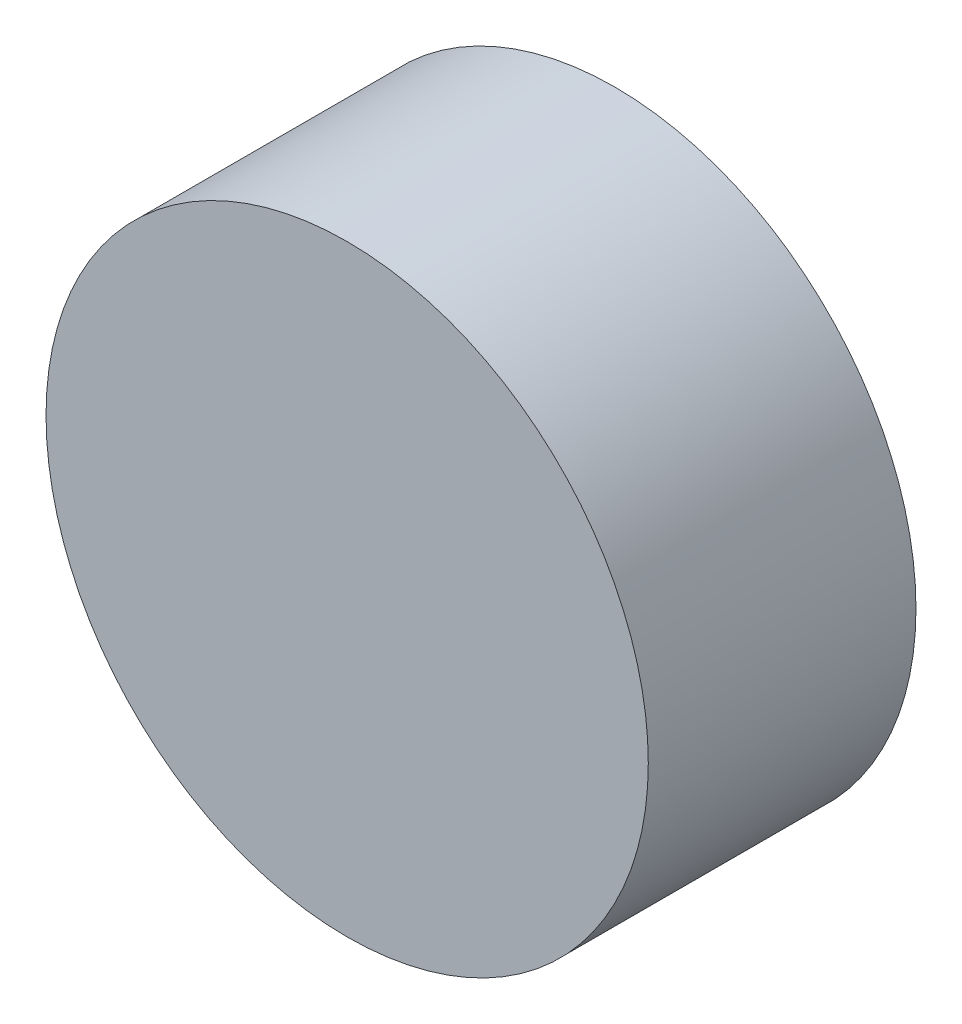
ISO-10303-21;
HEADER;
FILE_DESCRIPTION(('STEP AP214'),'2;1');
FILE_NAME('part.step','',(''),(''),'','','');
FILE_SCHEMA(('AUTOMOTIVE_DESIGN { 1 0 10303 214 1 1 1 1 }'));
ENDSEC;
DATA;
#1=APPLICATION_CONTEXT('core data for automotive mechanical design processes');
#2=APPLICATION_PROTOCOL_DEFINITION('international standard','automotive_design',2000,#1);
#3=PRODUCT_CONTEXT('',#1,'mechanical');
#4=PRODUCT('Part','Part','',(#3));
#5=PRODUCT_RELATED_PRODUCT_CATEGORY('part','',(#4));
#6=PRODUCT_DEFINITION_FORMATION('','',#4);
#7=PRODUCT_DEFINITION_CONTEXT('part definition',#1,'design');
#8=PRODUCT_DEFINITION('design','',#6,#7);
#9=PRODUCT_DEFINITION_SHAPE('','',#8);
#10=(LENGTH_UNIT() NAMED_UNIT(*) SI_UNIT(.MILLI.,.METRE.));
#11=(NAMED_UNIT(*) PLANE_ANGLE_UNIT() SI_UNIT($,.RADIAN.));
#12=(NAMED_UNIT(*) SI_UNIT($,.STERADIAN.) SOLID_ANGLE_UNIT());
#13=UNCERTAINTY_MEASURE_WITH_UNIT(LENGTH_MEASURE(1.E-05),#10,'distance_accuracy_value','');
#14=(GEOMETRIC_REPRESENTATION_CONTEXT(3) GLOBAL_UNCERTAINTY_ASSIGNED_CONTEXT((#13)) GLOBAL_UNIT_ASSIGNED_CONTEXT((#10,
#11,#12)) REPRESENTATION_CONTEXT('',''));
#15=CARTESIAN_POINT('',(0.,0.,0.));
#16=DIRECTION('',(0.,0.,1.));
#17=DIRECTION('',(1.,0.,0.));
#18=AXIS2_PLACEMENT_3D('',#15,#16,#17);
#19=CARTESIAN_POINT('',(0.,0.,4.));
#20=DIRECTION('',(0.,0.,-1.));
#21=DIRECTION('',(-1.,0.,0.));
#22=AXIS2_PLACEMENT_3D('',#19,#20,#21);
#23=CYLINDRICAL_SURFACE('',#22,4.5);
#24=CARTESIAN_POINT('',(0.,0.,4.));
#25=DIRECTION('',(0.,0.,1.));
#26=DIRECTION('',(1.,0.,0.));
#27=AXIS2_PLACEMENT_3D('',#24,#25,#26);
#28=CIRCLE('',#27,4.5);
#29=CARTESIAN_POINT('',(4.5,0.,4.));
#30=VERTEX_POINT('',#29);
#31=EDGE_CURVE('E10',#30,#30,#28,.T.);
#32=ORIENTED_EDGE('',*,*,#31,.F.);
#33=EDGE_LOOP('',(#32));
#34=FACE_BOUND('',#33,.T.);
#35=CARTESIAN_POINT('',(0.,0.,0.));
#36=DIRECTION('',(0.,0.,1.));
#37=DIRECTION('',(1.,0.,0.));
#38=AXIS2_PLACEMENT_3D('',#35,#36,#37);
#39=CIRCLE('',#38,4.5);
#40=CARTESIAN_POINT('',(4.5,0.,0.));
#41=VERTEX_POINT('',#40);
#42=EDGE_CURVE('E37',#41,#41,#39,.T.);
#43=ORIENTED_EDGE('',*,*,#42,.T.);
#44=EDGE_LOOP('',(#43));
#45=FACE_BOUND('',#44,.T.);
#46=ADVANCED_FACE('F34',(#34,#45),#23,.T.);
#47=CARTESIAN_POINT('',(0.,0.,4.));
#48=DIRECTION('',(0.,0.,1.));
#49=DIRECTION('',(1.,0.,0.));
#50=AXIS2_PLACEMENT_3D('',#47,#48,#49);
#51=PLANE('',#50);
#52=ORIENTED_EDGE('',*,*,#31,.T.);
#53=EDGE_LOOP('',(#52));
#54=FACE_BOUND('',#53,.T.);
#55=ADVANCED_FACE('F63',(#54),#51,.T.);
#56=CARTESIAN_POINT('',(0.,0.,0.));
#57=DIRECTION('',(0.,0.,1.));
#58=DIRECTION('',(1.,0.,0.));
#59=AXIS2_PLACEMENT_3D('',#56,#57,#58);
#60=PLANE('',#59);
#61=CARTESIAN_POINT('',(0.,0.,0.));
#62=DIRECTION('',(0.,0.,-1.));
#63=DIRECTION('',(-1.,0.,0.));
#64=AXIS2_PLACEMENT_3D('',#61,#62,#63);
#65=CIRCLE('',#64,2.5);
#66=CARTESIAN_POINT('',(-2.5,0.,0.));
#67=VERTEX_POINT('',#66);
#68=EDGE_CURVE('E46',#67,#67,#65,.T.);
#69=ORIENTED_EDGE('',*,*,#68,.F.);
#70=EDGE_LOOP('',(#69));
#71=FACE_BOUND('',#70,.T.);
#72=ORIENTED_EDGE('',*,*,#42,.F.);
#73=EDGE_LOOP('',(#72));
#74=FACE_BOUND('',#73,.T.);
#75=ADVANCED_FACE('F57',(#71,#74),#60,.F.);
#76=CARTESIAN_POINT('',(0.,0.,3.));
#77=DIRECTION('',(0.,0.,-1.));
#78=DIRECTION('',(-1.,0.,0.));
#79=AXIS2_PLACEMENT_3D('',#76,#77,#78);
#80=CYLINDRICAL_SURFACE('',#79,2.5);
#81=CARTESIAN_POINT('',(0.,0.,3.));
#82=DIRECTION('',(0.,0.,-1.));
#83=DIRECTION('',(-1.,0.,0.));
#84=AXIS2_PLACEMENT_3D('',#81,#82,#83);
#85=CIRCLE('',#84,2.5);
#86=CARTESIAN_POINT('',(-2.5,0.,3.));
#87=VERTEX_POINT('',#86);
#88=EDGE_CURVE('E44',#87,#87,#85,.T.);
#89=ORIENTED_EDGE('',*,*,#88,.F.);
#90=EDGE_LOOP('',(#89));
#91=FACE_BOUND('',#90,.T.);
#92=ORIENTED_EDGE('',*,*,#68,.T.);
#93=EDGE_LOOP('',(#92));
#94=FACE_BOUND('',#93,.T.);
#95=ADVANCED_FACE('F54',(#91,#94),#80,.F.);
#96=CARTESIAN_POINT('',(0.,0.,3.));
#97=DIRECTION('',(0.,0.,-1.));
#98=DIRECTION('',(-1.,0.,0.));
#99=AXIS2_PLACEMENT_3D('',#96,#97,#98);
#100=PLANE('',#99);
#101=ORIENTED_EDGE('',*,*,#88,.T.);
#102=EDGE_LOOP('',(#101));
#103=FACE_BOUND('',#102,.T.);
#104=ADVANCED_FACE('F52',(#103),#100,.T.);
#105=CLOSED_SHELL('',(#46,#55,#75,#95,#104));
#106=MANIFOLD_SOLID_BREP('B2',#105);
#107=ADVANCED_BREP_SHAPE_REPRESENTATION('',(#18,#106),#14);
#108=SHAPE_DEFINITION_REPRESENTATION(#9,#107);
ENDSEC;
END-ISO-10303-21;
